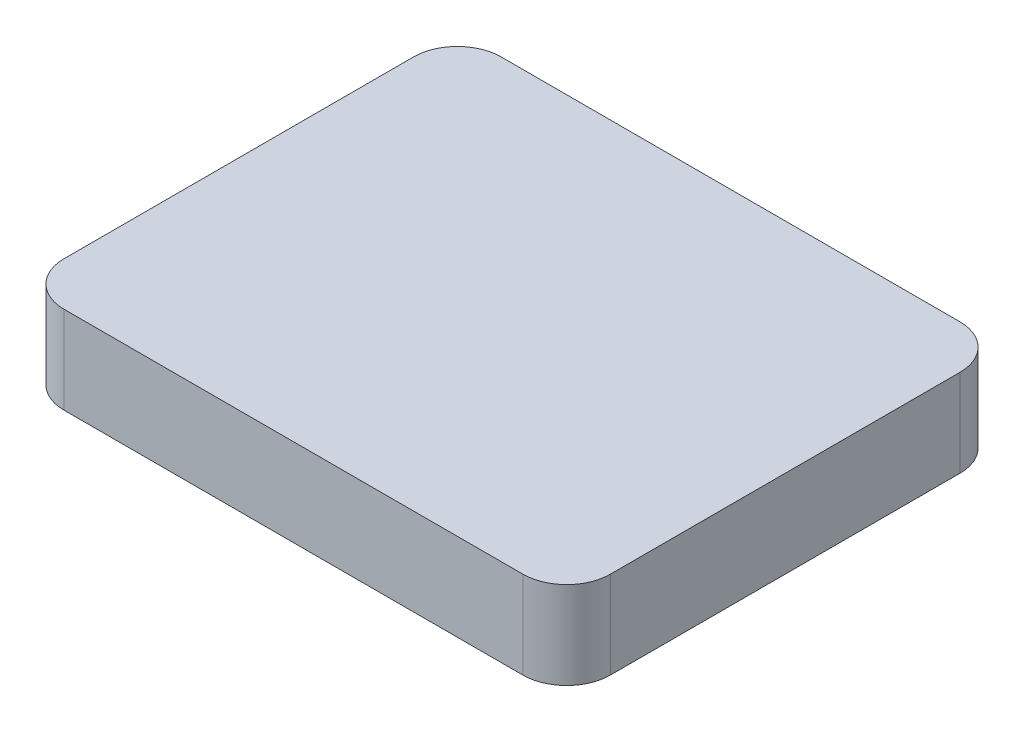
ISO-10303-21;
HEADER;
FILE_DESCRIPTION(('STEP AP214'),'2;1');
FILE_NAME('part.step','',(''),(''),'','','');
FILE_SCHEMA(('AUTOMOTIVE_DESIGN { 1 0 10303 214 1 1 1 1 }'));
ENDSEC;
DATA;
#1=APPLICATION_CONTEXT('core data for automotive mechanical design processes');
#2=APPLICATION_PROTOCOL_DEFINITION('international standard','automotive_design',2000,#1);
#3=PRODUCT_CONTEXT('',#1,'mechanical');
#4=PRODUCT('Part','Part','',(#3));
#5=PRODUCT_RELATED_PRODUCT_CATEGORY('part','',(#4));
#6=PRODUCT_DEFINITION_FORMATION('','',#4);
#7=PRODUCT_DEFINITION_CONTEXT('part definition',#1,'design');
#8=PRODUCT_DEFINITION('design','',#6,#7);
#9=PRODUCT_DEFINITION_SHAPE('','',#8);
#10=(LENGTH_UNIT() NAMED_UNIT(*) SI_UNIT(.MILLI.,.METRE.));
#11=(NAMED_UNIT(*) PLANE_ANGLE_UNIT() SI_UNIT($,.RADIAN.));
#12=(NAMED_UNIT(*) SI_UNIT($,.STERADIAN.) SOLID_ANGLE_UNIT());
#13=UNCERTAINTY_MEASURE_WITH_UNIT(LENGTH_MEASURE(1.E-05),#10,'distance_accuracy_value','');
#14=(GEOMETRIC_REPRESENTATION_CONTEXT(3) GLOBAL_UNCERTAINTY_ASSIGNED_CONTEXT((#13)) GLOBAL_UNIT_ASSIGNED_CONTEXT((#10,
#11,#12)) REPRESENTATION_CONTEXT('',''));
#15=CARTESIAN_POINT('',(0.,0.,0.));
#16=DIRECTION('',(0.,0.,1.));
#17=DIRECTION('',(1.,0.,0.));
#18=AXIS2_PLACEMENT_3D('',#15,#16,#17);
#19=CARTESIAN_POINT('',(125.,-20.0000000000003,120.));
#20=DIRECTION('',(-1.,0.,0.));
#21=DIRECTION('',(0.,0.,-1.));
#22=AXIS2_PLACEMENT_3D('',#19,#20,#21);
#23=PLANE('',#22);
#24=DIRECTION('',(0.,0.,1.));
#25=VECTOR('',#24,1.);
#26=CARTESIAN_POINT('',(125.,-20.0000000000003,120.));
#27=LINE('',#26,#25);
#28=CARTESIAN_POINT('',(125.,-19.9999999999997,-60.0000000000001));
#29=VERTEX_POINT('',#28);
#30=CARTESIAN_POINT('',(125.,-20.0000000000003,99.9999999999999));
#31=VERTEX_POINT('',#30);
#32=EDGE_CURVE('E142',#29,#31,#27,.T.);
#33=ORIENTED_EDGE('',*,*,#32,.F.);
#34=DIRECTION('',(0.,1.,0.));
#35=VECTOR('',#34,1.);
#36=CARTESIAN_POINT('',(125.,-19.9999999999997,-60.0000000000001));
#37=LINE('',#36,#35);
#38=CARTESIAN_POINT('',(125.,20.0000000000003,-59.9999999999999));
#39=VERTEX_POINT('',#38);
#40=EDGE_CURVE('E12',#29,#39,#37,.T.);
#41=ORIENTED_EDGE('',*,*,#40,.T.);
#42=DIRECTION('',(0.,0.,1.));
#43=VECTOR('',#42,1.);
#44=CARTESIAN_POINT('',(125.,19.9999999999996,120.));
#45=LINE('',#44,#43);
#46=CARTESIAN_POINT('',(125.,19.9999999999997,100.));
#47=VERTEX_POINT('',#46);
#48=EDGE_CURVE('E152',#39,#47,#45,.T.);
#49=ORIENTED_EDGE('',*,*,#48,.T.);
#50=DIRECTION('',(0.,1.,0.));
#51=VECTOR('',#50,1.);
#52=CARTESIAN_POINT('',(125.,-20.0000000000003,99.9999999999999));
#53=LINE('',#52,#51);
#54=EDGE_CURVE('E53',#47,#31,#53,.F.);
#55=ORIENTED_EDGE('',*,*,#54,.T.);
#56=EDGE_LOOP('',(#33,#41,#49,#55));
#57=FACE_BOUND('',#56,.T.);
#58=ADVANCED_FACE('F44',(#57),#23,.F.);
#59=CARTESIAN_POINT('',(-125.,-20.0000000000003,120.));
#60=DIRECTION('',(0.,0.,-1.));
#61=DIRECTION('',(0.,1.,0.));
#62=AXIS2_PLACEMENT_3D('',#59,#60,#61);
#63=PLANE('',#62);
#64=DIRECTION('',(-1.,0.,0.));
#65=VECTOR('',#64,1.);
#66=CARTESIAN_POINT('',(-125.,19.9999999999996,120.));
#67=LINE('',#66,#65);
#68=CARTESIAN_POINT('',(105.,19.9999999999996,120.));
#69=VERTEX_POINT('',#68);
#70=CARTESIAN_POINT('',(-105.,19.9999999999996,120.));
#71=VERTEX_POINT('',#70);
#72=EDGE_CURVE('E149',#69,#71,#67,.T.);
#73=ORIENTED_EDGE('',*,*,#72,.T.);
#74=DIRECTION('',(0.,1.,0.));
#75=VECTOR('',#74,1.);
#76=CARTESIAN_POINT('',(-105.,-20.0000000000003,120.));
#77=LINE('',#76,#75);
#78=CARTESIAN_POINT('',(-105.,-20.0000000000003,120.));
#79=VERTEX_POINT('',#78);
#80=EDGE_CURVE('E60',#71,#79,#77,.F.);
#81=ORIENTED_EDGE('',*,*,#80,.T.);
#82=DIRECTION('',(-1.,0.,0.));
#83=VECTOR('',#82,1.);
#84=CARTESIAN_POINT('',(-125.,-20.0000000000003,120.));
#85=LINE('',#84,#83);
#86=CARTESIAN_POINT('',(105.,-20.0000000000003,120.));
#87=VERTEX_POINT('',#86);
#88=EDGE_CURVE('E147',#87,#79,#85,.T.);
#89=ORIENTED_EDGE('',*,*,#88,.F.);
#90=DIRECTION('',(0.,1.,0.));
#91=VECTOR('',#90,1.);
#92=CARTESIAN_POINT('',(105.,-20.0000000000003,120.));
#93=LINE('',#92,#91);
#94=EDGE_CURVE('E188',#87,#69,#93,.T.);
#95=ORIENTED_EDGE('',*,*,#94,.T.);
#96=EDGE_LOOP('',(#73,#81,#89,#95));
#97=FACE_BOUND('',#96,.T.);
#98=ADVANCED_FACE('F204',(#97),#63,.F.);
#99=CARTESIAN_POINT('',(-125.,-20.0000000000003,120.));
#100=DIRECTION('',(1.,0.,0.));
#101=DIRECTION('',(0.,0.,1.));
#102=AXIS2_PLACEMENT_3D('',#99,#100,#101);
#103=PLANE('',#102);
#104=DIRECTION('',(0.,0.,-1.));
#105=VECTOR('',#104,1.);
#106=CARTESIAN_POINT('',(-125.,19.9999999999996,120.));
#107=LINE('',#106,#105);
#108=CARTESIAN_POINT('',(-125.,19.9999999999997,100.));
#109=VERTEX_POINT('',#108);
#110=CARTESIAN_POINT('',(-125.,20.0000000000003,-59.9999999999999));
#111=VERTEX_POINT('',#110);
#112=EDGE_CURVE('E143',#109,#111,#107,.T.);
#113=ORIENTED_EDGE('',*,*,#112,.T.);
#114=DIRECTION('',(0.,1.,0.));
#115=VECTOR('',#114,1.);
#116=CARTESIAN_POINT('',(-125.,-19.9999999999997,-60.0000000000001));
#117=LINE('',#116,#115);
#118=CARTESIAN_POINT('',(-125.,-19.9999999999997,-60.0000000000001));
#119=VERTEX_POINT('',#118);
#120=EDGE_CURVE('E117',#111,#119,#117,.F.);
#121=ORIENTED_EDGE('',*,*,#120,.T.);
#122=DIRECTION('',(0.,0.,-1.));
#123=VECTOR('',#122,1.);
#124=CARTESIAN_POINT('',(-125.,-20.0000000000003,120.));
#125=LINE('',#124,#123);
#126=CARTESIAN_POINT('',(-125.,-20.0000000000003,99.9999999999999));
#127=VERTEX_POINT('',#126);
#128=EDGE_CURVE('E157',#127,#119,#125,.T.);
#129=ORIENTED_EDGE('',*,*,#128,.F.);
#130=DIRECTION('',(0.,1.,0.));
#131=VECTOR('',#130,1.);
#132=CARTESIAN_POINT('',(-125.,-20.0000000000003,99.9999999999999));
#133=LINE('',#132,#131);
#134=EDGE_CURVE('E123',#127,#109,#133,.T.);
#135=ORIENTED_EDGE('',*,*,#134,.T.);
#136=EDGE_LOOP('',(#113,#121,#129,#135));
#137=FACE_BOUND('',#136,.T.);
#138=ADVANCED_FACE('F211',(#137),#103,.F.);
#139=CARTESIAN_POINT('',(-125.,-19.9999999999997,-80.0000000000001));
#140=DIRECTION('',(0.,0.,1.));
#141=DIRECTION('',(0.,-1.,0.));
#142=AXIS2_PLACEMENT_3D('',#139,#140,#141);
#143=PLANE('',#142);
#144=DIRECTION('',(1.,0.,0.));
#145=VECTOR('',#144,1.);
#146=CARTESIAN_POINT('',(-125.,-19.9999999999997,-80.0000000000001));
#147=LINE('',#146,#145);
#148=CARTESIAN_POINT('',(-105.,-19.9999999999997,-80.0000000000001));
#149=VERTEX_POINT('',#148);
#150=CARTESIAN_POINT('',(105.,-19.9999999999997,-80.0000000000001));
#151=VERTEX_POINT('',#150);
#152=EDGE_CURVE('E133',#149,#151,#147,.T.);
#153=ORIENTED_EDGE('',*,*,#152,.F.);
#154=DIRECTION('',(0.,1.,0.));
#155=VECTOR('',#154,1.);
#156=CARTESIAN_POINT('',(-105.,-19.9999999999997,-80.0000000000001));
#157=LINE('',#156,#155);
#158=CARTESIAN_POINT('',(-105.,20.0000000000004,-79.9999999999999));
#159=VERTEX_POINT('',#158);
#160=EDGE_CURVE('E116',#149,#159,#157,.T.);
#161=ORIENTED_EDGE('',*,*,#160,.T.);
#162=DIRECTION('',(1.,0.,0.));
#163=VECTOR('',#162,1.);
#164=CARTESIAN_POINT('',(-125.,20.0000000000004,-79.9999999999999));
#165=LINE('',#164,#163);
#166=CARTESIAN_POINT('',(105.,20.0000000000004,-79.9999999999999));
#167=VERTEX_POINT('',#166);
#168=EDGE_CURVE('E130',#159,#167,#165,.T.);
#169=ORIENTED_EDGE('',*,*,#168,.T.);
#170=DIRECTION('',(0.,1.,0.));
#171=VECTOR('',#170,1.);
#172=CARTESIAN_POINT('',(105.,-19.9999999999997,-80.0000000000001));
#173=LINE('',#172,#171);
#174=EDGE_CURVE('E136',#167,#151,#173,.F.);
#175=ORIENTED_EDGE('',*,*,#174,.T.);
#176=EDGE_LOOP('',(#153,#161,#169,#175));
#177=FACE_BOUND('',#176,.T.);
#178=ADVANCED_FACE('F129',(#177),#143,.F.);
#179=CARTESIAN_POINT('',(0.,-20.,19.9999999999999));
#180=DIRECTION('',(0.,-1.,0.));
#181=DIRECTION('',(1.,0.,0.));
#182=AXIS2_PLACEMENT_3D('',#179,#180,#181);
#183=PLANE('',#182);
#184=ORIENTED_EDGE('',*,*,#128,.T.);
#185=CARTESIAN_POINT('',(-105.,-19.9999999999997,-60.0000000000001));
#186=DIRECTION('',(0.,-1.,0.));
#187=DIRECTION('',(0.,0.,-1.));
#188=AXIS2_PLACEMENT_3D('',#185,#186,#187);
#189=CIRCLE('',#188,20.);
#190=EDGE_CURVE('E185',#119,#149,#189,.T.);
#191=ORIENTED_EDGE('',*,*,#190,.T.);
#192=ORIENTED_EDGE('',*,*,#152,.T.);
#193=CARTESIAN_POINT('',(105.,-19.9999999999997,-60.0000000000001));
#194=DIRECTION('',(0.,-1.,0.));
#195=DIRECTION('',(0.,0.,-1.));
#196=AXIS2_PLACEMENT_3D('',#193,#194,#195);
#197=CIRCLE('',#196,20.);
#198=EDGE_CURVE('E179',#151,#29,#197,.T.);
#199=ORIENTED_EDGE('',*,*,#198,.T.);
#200=ORIENTED_EDGE('',*,*,#32,.T.);
#201=CARTESIAN_POINT('',(105.,-20.0000000000003,99.9999999999999));
#202=DIRECTION('',(0.,-1.,0.));
#203=DIRECTION('',(0.,0.,-1.));
#204=AXIS2_PLACEMENT_3D('',#201,#202,#203);
#205=CIRCLE('',#204,20.);
#206=EDGE_CURVE('E67',#31,#87,#205,.T.);
#207=ORIENTED_EDGE('',*,*,#206,.T.);
#208=ORIENTED_EDGE('',*,*,#88,.T.);
#209=CARTESIAN_POINT('',(-105.,-20.0000000000003,99.9999999999999));
#210=DIRECTION('',(0.,-1.,0.));
#211=DIRECTION('',(0.,0.,-1.));
#212=AXIS2_PLACEMENT_3D('',#209,#210,#211);
#213=CIRCLE('',#212,20.);
#214=EDGE_CURVE('E182',#79,#127,#213,.T.);
#215=ORIENTED_EDGE('',*,*,#214,.T.);
#216=EDGE_LOOP('',(#184,#191,#192,#199,#200,#207,#208,#215));
#217=FACE_BOUND('',#216,.T.);
#218=ADVANCED_FACE('F200',(#217),#183,.T.);
#219=CARTESIAN_POINT('',(0.,20.,20.0000000000001));
#220=DIRECTION('',(0.,-1.,0.));
#221=DIRECTION('',(1.,0.,0.));
#222=AXIS2_PLACEMENT_3D('',#219,#220,#221);
#223=PLANE('',#222);
#224=ORIENTED_EDGE('',*,*,#168,.F.);
#225=CARTESIAN_POINT('',(-105.,20.0000000000003,-59.9999999999999));
#226=DIRECTION('',(0.,-1.,0.));
#227=DIRECTION('',(0.,0.,-1.));
#228=AXIS2_PLACEMENT_3D('',#225,#226,#227);
#229=CIRCLE('',#228,20.);
#230=EDGE_CURVE('E112',#159,#111,#229,.F.);
#231=ORIENTED_EDGE('',*,*,#230,.T.);
#232=ORIENTED_EDGE('',*,*,#112,.F.);
#233=CARTESIAN_POINT('',(-105.,19.9999999999997,100.));
#234=DIRECTION('',(0.,-1.,0.));
#235=DIRECTION('',(0.,0.,-1.));
#236=AXIS2_PLACEMENT_3D('',#233,#234,#235);
#237=CIRCLE('',#236,20.);
#238=EDGE_CURVE('E124',#109,#71,#237,.F.);
#239=ORIENTED_EDGE('',*,*,#238,.T.);
#240=ORIENTED_EDGE('',*,*,#72,.F.);
#241=CARTESIAN_POINT('',(105.,19.9999999999997,100.));
#242=DIRECTION('',(0.,-1.,0.));
#243=DIRECTION('',(0.,0.,-1.));
#244=AXIS2_PLACEMENT_3D('',#241,#242,#243);
#245=CIRCLE('',#244,20.);
#246=EDGE_CURVE('E135',#69,#47,#245,.F.);
#247=ORIENTED_EDGE('',*,*,#246,.T.);
#248=ORIENTED_EDGE('',*,*,#48,.F.);
#249=CARTESIAN_POINT('',(105.,20.0000000000003,-59.9999999999999));
#250=DIRECTION('',(0.,-1.,0.));
#251=DIRECTION('',(0.,0.,-1.));
#252=AXIS2_PLACEMENT_3D('',#249,#250,#251);
#253=CIRCLE('',#252,20.);
#254=EDGE_CURVE('E140',#39,#167,#253,.F.);
#255=ORIENTED_EDGE('',*,*,#254,.T.);
#256=EDGE_LOOP('',(#224,#231,#232,#239,#240,#247,#248,#255));
#257=FACE_BOUND('',#256,.T.);
#258=ADVANCED_FACE('F138',(#257),#223,.F.);
#259=CARTESIAN_POINT('',(-105.,-19.9999999999997,-60.0000000000001));
#260=DIRECTION('',(0.,1.,0.));
#261=DIRECTION('',(0.,0.,1.));
#262=AXIS2_PLACEMENT_3D('',#259,#260,#261);
#263=CYLINDRICAL_SURFACE('',#262,20.);
#264=ORIENTED_EDGE('',*,*,#190,.F.);
#265=ORIENTED_EDGE('',*,*,#120,.F.);
#266=ORIENTED_EDGE('',*,*,#230,.F.);
#267=ORIENTED_EDGE('',*,*,#160,.F.);
#268=EDGE_LOOP('',(#264,#265,#266,#267));
#269=FACE_BOUND('',#268,.T.);
#270=ADVANCED_FACE('F115',(#269),#263,.T.);
#271=CARTESIAN_POINT('',(-105.,-20.0000000000003,99.9999999999999));
#272=DIRECTION('',(0.,1.,0.));
#273=DIRECTION('',(0.,0.,1.));
#274=AXIS2_PLACEMENT_3D('',#271,#272,#273);
#275=CYLINDRICAL_SURFACE('',#274,20.);
#276=ORIENTED_EDGE('',*,*,#214,.F.);
#277=ORIENTED_EDGE('',*,*,#80,.F.);
#278=ORIENTED_EDGE('',*,*,#238,.F.);
#279=ORIENTED_EDGE('',*,*,#134,.F.);
#280=EDGE_LOOP('',(#276,#277,#278,#279));
#281=FACE_BOUND('',#280,.T.);
#282=ADVANCED_FACE('F208',(#281),#275,.T.);
#283=CARTESIAN_POINT('',(105.,-19.9999999999997,-60.0000000000001));
#284=DIRECTION('',(0.,1.,0.));
#285=DIRECTION('',(0.,0.,1.));
#286=AXIS2_PLACEMENT_3D('',#283,#284,#285);
#287=CYLINDRICAL_SURFACE('',#286,20.);
#288=ORIENTED_EDGE('',*,*,#198,.F.);
#289=ORIENTED_EDGE('',*,*,#174,.F.);
#290=ORIENTED_EDGE('',*,*,#254,.F.);
#291=ORIENTED_EDGE('',*,*,#40,.F.);
#292=EDGE_LOOP('',(#288,#289,#290,#291));
#293=FACE_BOUND('',#292,.T.);
#294=ADVANCED_FACE('F213',(#293),#287,.T.);
#295=CARTESIAN_POINT('',(105.,-20.0000000000003,99.9999999999999));
#296=DIRECTION('',(0.,1.,0.));
#297=DIRECTION('',(0.,0.,1.));
#298=AXIS2_PLACEMENT_3D('',#295,#296,#297);
#299=CYLINDRICAL_SURFACE('',#298,20.);
#300=ORIENTED_EDGE('',*,*,#206,.F.);
#301=ORIENTED_EDGE('',*,*,#54,.F.);
#302=ORIENTED_EDGE('',*,*,#246,.F.);
#303=ORIENTED_EDGE('',*,*,#94,.F.);
#304=EDGE_LOOP('',(#300,#301,#302,#303));
#305=FACE_BOUND('',#304,.T.);
#306=ADVANCED_FACE('F46',(#305),#299,.T.);
#307=CLOSED_SHELL('',(#58,#98,#138,#178,#218,#258,#270,#282,#294,#306));
#308=MANIFOLD_SOLID_BREP('B2',#307);
#309=ADVANCED_BREP_SHAPE_REPRESENTATION('',(#18,#308),#14);
#310=SHAPE_DEFINITION_REPRESENTATION(#9,#309);
ENDSEC;
END-ISO-10303-21;
